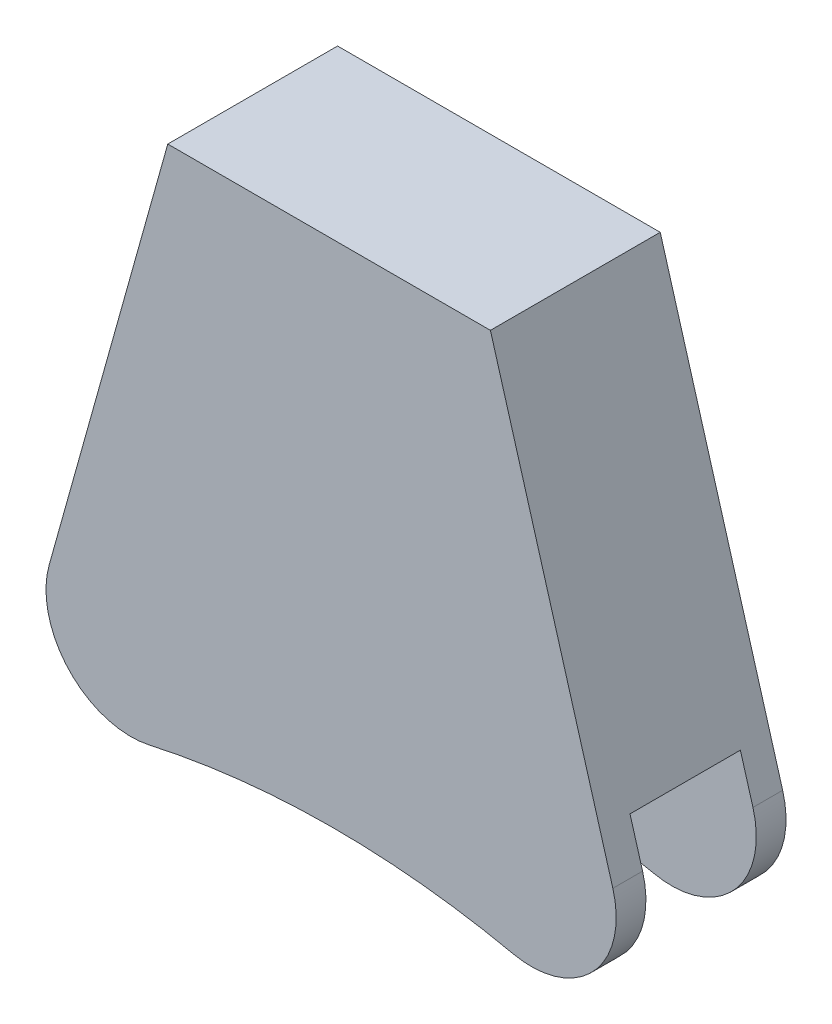
ISO-10303-21;
HEADER;
FILE_DESCRIPTION(('STEP AP214'),'2;1');
FILE_NAME('part.step','',(''),(''),'','','');
FILE_SCHEMA(('AUTOMOTIVE_DESIGN { 1 0 10303 214 1 1 1 1 }'));
ENDSEC;
DATA;
#1=APPLICATION_CONTEXT('core data for automotive mechanical design processes');
#2=APPLICATION_PROTOCOL_DEFINITION('international standard','automotive_design',2000,#1);
#3=PRODUCT_CONTEXT('',#1,'mechanical');
#4=PRODUCT('Part','Part','',(#3));
#5=PRODUCT_RELATED_PRODUCT_CATEGORY('part','',(#4));
#6=PRODUCT_DEFINITION_FORMATION('','',#4);
#7=PRODUCT_DEFINITION_CONTEXT('part definition',#1,'design');
#8=PRODUCT_DEFINITION('design','',#6,#7);
#9=PRODUCT_DEFINITION_SHAPE('','',#8);
#10=(LENGTH_UNIT() NAMED_UNIT(*) SI_UNIT(.MILLI.,.METRE.));
#11=(NAMED_UNIT(*) PLANE_ANGLE_UNIT() SI_UNIT($,.RADIAN.));
#12=(NAMED_UNIT(*) SI_UNIT($,.STERADIAN.) SOLID_ANGLE_UNIT());
#13=UNCERTAINTY_MEASURE_WITH_UNIT(LENGTH_MEASURE(1.E-05),#10,'distance_accuracy_value','');
#14=(GEOMETRIC_REPRESENTATION_CONTEXT(3) GLOBAL_UNCERTAINTY_ASSIGNED_CONTEXT((#13)) GLOBAL_UNIT_ASSIGNED_CONTEXT((#10,
#11,#12)) REPRESENTATION_CONTEXT('',''));
#15=CARTESIAN_POINT('',(0.,0.,0.));
#16=DIRECTION('',(0.,0.,1.));
#17=DIRECTION('',(1.,0.,0.));
#18=AXIS2_PLACEMENT_3D('',#15,#16,#17);
#19=CARTESIAN_POINT('',(-1.40770229888838,-160.,10.));
#20=DIRECTION('',(0.,0.,-1.));
#21=DIRECTION('',(-1.,0.,0.));
#22=AXIS2_PLACEMENT_3D('',#19,#20,#21);
#23=CYLINDRICAL_SURFACE('',#22,100.);
#24=CARTESIAN_POINT('',(-1.40770229888838,-160.,-10.));
#25=DIRECTION('',(0.,0.,-1.));
#26=DIRECTION('',(-1.,0.,0.));
#27=AXIS2_PLACEMENT_3D('',#24,#25,#26);
#28=CIRCLE('',#27,100.);
#29=CARTESIAN_POINT('',(-23.1221272501221,-62.3860473649528,-10.));
#30=VERTEX_POINT('',#29);
#31=CARTESIAN_POINT('',(19.7499055757312,-62.2638468680917,-10.));
#32=VERTEX_POINT('',#31);
#33=EDGE_CURVE('E181',#30,#32,#28,.T.);
#34=ORIENTED_EDGE('',*,*,#33,.T.);
#35=DIRECTION('',(0.,0.,-1.));
#36=VECTOR('',#35,1.);
#37=CARTESIAN_POINT('',(19.7499055757312,-62.2638468680916,10.));
#38=LINE('',#37,#36);
#39=CARTESIAN_POINT('',(19.7499055757312,-62.2638468680917,-6.50000000000002));
#40=VERTEX_POINT('',#39);
#41=EDGE_CURVE('E239',#32,#40,#38,.F.);
#42=ORIENTED_EDGE('',*,*,#41,.T.);
#43=CARTESIAN_POINT('',(-1.40770229888838,-160.,-6.50000000000002));
#44=DIRECTION('',(0.,0.,-1.));
#45=DIRECTION('',(-1.,0.,0.));
#46=AXIS2_PLACEMENT_3D('',#43,#44,#45);
#47=CIRCLE('',#46,100.);
#48=CARTESIAN_POINT('',(-23.1221272501221,-62.3860473649528,-6.50000000000002));
#49=VERTEX_POINT('',#48);
#50=EDGE_CURVE('E150',#40,#49,#47,.F.);
#51=ORIENTED_EDGE('',*,*,#50,.T.);
#52=DIRECTION('',(0.,0.,-1.));
#53=VECTOR('',#52,1.);
#54=CARTESIAN_POINT('',(-23.1221272501221,-62.3860473649528,10.));
#55=LINE('',#54,#53);
#56=EDGE_CURVE('E235',#49,#30,#55,.T.);
#57=ORIENTED_EDGE('',*,*,#56,.T.);
#58=EDGE_LOOP('',(#34,#42,#51,#57));
#59=FACE_BOUND('',#58,.T.);
#60=ADVANCED_FACE('F38',(#59),#23,.F.);
#61=CARTESIAN_POINT('',(-20.9513829902926,0.,10.));
#62=DIRECTION('',(0.,1.,0.));
#63=DIRECTION('',(-1.,0.,0.));
#64=AXIS2_PLACEMENT_3D('',#61,#62,#63);
#65=PLANE('',#64);
#66=DIRECTION('',(1.,0.,0.));
#67=VECTOR('',#66,1.);
#68=CARTESIAN_POINT('',(-20.9513829902926,0.,-10.));
#69=LINE('',#68,#67);
#70=CARTESIAN_POINT('',(-20.9513829902926,0.,-10.));
#71=VERTEX_POINT('',#70);
#72=CARTESIAN_POINT('',(17.0486170097074,0.,-10.));
#73=VERTEX_POINT('',#72);
#74=EDGE_CURVE('E149',#71,#73,#69,.T.);
#75=ORIENTED_EDGE('',*,*,#74,.F.);
#76=DIRECTION('',(0.,0.,-1.));
#77=VECTOR('',#76,1.);
#78=CARTESIAN_POINT('',(-20.9513829902926,0.,10.));
#79=LINE('',#78,#77);
#80=CARTESIAN_POINT('',(-20.9513829902926,0.,10.));
#81=VERTEX_POINT('',#80);
#82=EDGE_CURVE('E187',#81,#71,#79,.T.);
#83=ORIENTED_EDGE('',*,*,#82,.F.);
#84=DIRECTION('',(1.,0.,0.));
#85=VECTOR('',#84,1.);
#86=CARTESIAN_POINT('',(-20.9513829902926,0.,10.));
#87=LINE('',#86,#85);
#88=CARTESIAN_POINT('',(17.0486170097074,0.,10.));
#89=VERTEX_POINT('',#88);
#90=EDGE_CURVE('E161',#81,#89,#87,.T.);
#91=ORIENTED_EDGE('',*,*,#90,.T.);
#92=DIRECTION('',(0.,0.,-1.));
#93=VECTOR('',#92,1.);
#94=CARTESIAN_POINT('',(17.0486170097074,0.,10.));
#95=LINE('',#94,#93);
#96=EDGE_CURVE('E176',#89,#73,#95,.T.);
#97=ORIENTED_EDGE('',*,*,#96,.T.);
#98=EDGE_LOOP('',(#75,#83,#91,#97));
#99=FACE_BOUND('',#98,.T.);
#100=ADVANCED_FACE('F279',(#99),#65,.T.);
#101=CARTESIAN_POINT('',(-39.8975314430219,-67.7041005653263,10.));
#102=DIRECTION('',(-0.963004631843198,0.269484840108949,0.));
#103=DIRECTION('',(-0.269484840108949,-0.963004631843198,0.));
#104=AXIS2_PLACEMENT_3D('',#101,#102,#103);
#105=PLANE('',#104);
#106=DIRECTION('',(0.269484840108949,0.963004631843198,0.));
#107=VECTOR('',#106,1.);
#108=CARTESIAN_POINT('',(-39.8975314430219,-67.7041005653263,-10.));
#109=LINE('',#108,#107);
#110=CARTESIAN_POINT('',(-34.9236160636775,-49.9298037003586,-10.));
#111=VERTEX_POINT('',#110);
#112=EDGE_CURVE('E166',#111,#71,#109,.T.);
#113=ORIENTED_EDGE('',*,*,#112,.F.);
#114=DIRECTION('',(0.,0.,1.));
#115=VECTOR('',#114,1.);
#116=CARTESIAN_POINT('',(-34.9236160636775,-49.9298037003586,-6.50000000000002));
#117=LINE('',#116,#115);
#118=CARTESIAN_POINT('',(-34.9236160636775,-49.9298037003586,-6.50000000000002));
#119=VERTEX_POINT('',#118);
#120=EDGE_CURVE('E11',#111,#119,#117,.T.);
#121=ORIENTED_EDGE('',*,*,#120,.T.);
#122=DIRECTION('',(-0.269484840108949,-0.963004631843198,0.));
#123=VECTOR('',#122,1.);
#124=CARTESIAN_POINT('',(-39.8975314430219,-67.7041005653263,-6.50000000000002));
#125=LINE('',#124,#123);
#126=CARTESIAN_POINT('',(-33.7909251556847,-45.8821304048859,-6.50000000000002));
#127=VERTEX_POINT('',#126);
#128=EDGE_CURVE('E142',#127,#119,#125,.T.);
#129=ORIENTED_EDGE('',*,*,#128,.F.);
#130=DIRECTION('',(0.,0.,1.));
#131=VECTOR('',#130,1.);
#132=CARTESIAN_POINT('',(-33.7909251556847,-45.8821304048859,0.));
#133=LINE('',#132,#131);
#134=CARTESIAN_POINT('',(-33.7909251556847,-45.8821304048859,6.49999999999998));
#135=VERTEX_POINT('',#134);
#136=EDGE_CURVE('E130',#135,#127,#133,.F.);
#137=ORIENTED_EDGE('',*,*,#136,.F.);
#138=DIRECTION('',(0.269484840108949,0.963004631843198,0.));
#139=VECTOR('',#138,1.);
#140=CARTESIAN_POINT('',(-39.8975314430219,-67.7041005653263,6.49999999999998));
#141=LINE('',#140,#139);
#142=CARTESIAN_POINT('',(-34.9236160636775,-49.9298037003586,6.49999999999998));
#143=VERTEX_POINT('',#142);
#144=EDGE_CURVE('E157',#143,#135,#141,.T.);
#145=ORIENTED_EDGE('',*,*,#144,.F.);
#146=DIRECTION('',(0.,0.,1.));
#147=VECTOR('',#146,1.);
#148=CARTESIAN_POINT('',(-34.9236160636775,-49.9298037003586,10.));
#149=LINE('',#148,#147);
#150=CARTESIAN_POINT('',(-34.9236160636775,-49.9298037003586,10.));
#151=VERTEX_POINT('',#150);
#152=EDGE_CURVE('E47',#143,#151,#149,.T.);
#153=ORIENTED_EDGE('',*,*,#152,.T.);
#154=DIRECTION('',(0.269484840108949,0.963004631843198,0.));
#155=VECTOR('',#154,1.);
#156=CARTESIAN_POINT('',(-39.8975314430219,-67.7041005653263,10.));
#157=LINE('',#156,#155);
#158=EDGE_CURVE('E174',#151,#81,#157,.T.);
#159=ORIENTED_EDGE('',*,*,#158,.T.);
#160=ORIENTED_EDGE('',*,*,#82,.T.);
#161=EDGE_LOOP('',(#113,#121,#129,#137,#145,#153,#159,#160));
#162=FACE_BOUND('',#161,.T.);
#163=ADVANCED_FACE('F147',(#162),#105,.T.);
#164=CARTESIAN_POINT('',(-1.40770229888838,-160.,6.49999999999998));
#165=DIRECTION('',(0.,0.,1.));
#166=DIRECTION('',(1.,0.,0.));
#167=AXIS2_PLACEMENT_3D('',#164,#165,#166);
#168=CIRCLE('',#167,100.);
#169=CARTESIAN_POINT('',(-23.1221272501221,-62.3860473649528,6.49999999999998));
#170=VERTEX_POINT('',#169);
#171=CARTESIAN_POINT('',(19.7499055757312,-62.2638468680917,6.49999999999998));
#172=VERTEX_POINT('',#171);
#173=EDGE_CURVE('E139',#170,#172,#168,.F.);
#174=ORIENTED_EDGE('',*,*,#173,.T.);
#175=DIRECTION('',(0.,0.,-1.));
#176=VECTOR('',#175,1.);
#177=CARTESIAN_POINT('',(19.7499055757312,-62.2638468680916,10.));
#178=LINE('',#177,#176);
#179=CARTESIAN_POINT('',(19.7499055757312,-62.2638468680917,10.));
#180=VERTEX_POINT('',#179);
#181=EDGE_CURVE('E220',#172,#180,#178,.F.);
#182=ORIENTED_EDGE('',*,*,#181,.T.);
#183=CARTESIAN_POINT('',(-1.40770229888838,-160.,10.));
#184=DIRECTION('',(0.,0.,-1.));
#185=DIRECTION('',(-1.,0.,0.));
#186=AXIS2_PLACEMENT_3D('',#183,#184,#185);
#187=CIRCLE('',#186,100.);
#188=CARTESIAN_POINT('',(-23.1221272501221,-62.3860473649528,10.));
#189=VERTEX_POINT('',#188);
#190=EDGE_CURVE('E170',#189,#180,#187,.T.);
#191=ORIENTED_EDGE('',*,*,#190,.F.);
#192=DIRECTION('',(0.,0.,-1.));
#193=VECTOR('',#192,1.);
#194=CARTESIAN_POINT('',(-23.1221272501221,-62.3860473649528,10.));
#195=LINE('',#194,#193);
#196=EDGE_CURVE('E216',#189,#170,#195,.T.);
#197=ORIENTED_EDGE('',*,*,#196,.T.);
#198=EDGE_LOOP('',(#174,#182,#191,#197));
#199=FACE_BOUND('',#198,.T.);
#200=ADVANCED_FACE('F261',(#199),#23,.F.);
#201=CARTESIAN_POINT('',(17.0486170097074,0.,10.));
#202=DIRECTION('',(0.960393495176608,0.278647329831921,0.));
#203=DIRECTION('',(-0.278647329831921,0.960393495176608,0.));
#204=AXIS2_PLACEMENT_3D('',#201,#202,#203);
#205=PLANE('',#204);
#206=DIRECTION('',(0.278647329831921,-0.960393495176608,0.));
#207=VECTOR('',#206,1.);
#208=CARTESIAN_POINT('',(17.0486170097074,0.,10.));
#209=LINE('',#208,#207);
#210=CARTESIAN_POINT('',(31.4696013149592,-49.7037582565816,10.));
#211=VERTEX_POINT('',#210);
#212=EDGE_CURVE('E165',#89,#211,#209,.T.);
#213=ORIENTED_EDGE('',*,*,#212,.T.);
#214=DIRECTION('',(0.,0.,1.));
#215=VECTOR('',#214,1.);
#216=CARTESIAN_POINT('',(31.4696013149592,-49.7037582565816,6.49999999999998));
#217=LINE('',#216,#215);
#218=CARTESIAN_POINT('',(31.4696013149592,-49.7037582565816,6.49999999999998));
#219=VERTEX_POINT('',#218);
#220=EDGE_CURVE('E206',#211,#219,#217,.F.);
#221=ORIENTED_EDGE('',*,*,#220,.T.);
#222=DIRECTION('',(0.278647329831921,-0.960393495176608,0.));
#223=VECTOR('',#222,1.);
#224=CARTESIAN_POINT('',(17.0486170097074,0.,6.49999999999998));
#225=LINE('',#224,#223);
#226=CARTESIAN_POINT('',(29.9896205979097,-44.602816307852,6.49999999999998));
#227=VERTEX_POINT('',#226);
#228=EDGE_CURVE('E196',#227,#219,#225,.T.);
#229=ORIENTED_EDGE('',*,*,#228,.F.);
#230=DIRECTION('',(0.,0.,1.));
#231=VECTOR('',#230,1.);
#232=CARTESIAN_POINT('',(29.9896205979097,-44.602816307852,0.));
#233=LINE('',#232,#231);
#234=CARTESIAN_POINT('',(29.9896205979097,-44.602816307852,-6.50000000000002));
#235=VERTEX_POINT('',#234);
#236=EDGE_CURVE('E191',#235,#227,#233,.T.);
#237=ORIENTED_EDGE('',*,*,#236,.F.);
#238=DIRECTION('',(-0.278647329831921,0.960393495176608,0.));
#239=VECTOR('',#238,1.);
#240=CARTESIAN_POINT('',(17.0486170097074,0.,-6.50000000000002));
#241=LINE('',#240,#239);
#242=CARTESIAN_POINT('',(31.4696013149592,-49.7037582565816,-6.50000000000002));
#243=VERTEX_POINT('',#242);
#244=EDGE_CURVE('E144',#243,#235,#241,.T.);
#245=ORIENTED_EDGE('',*,*,#244,.F.);
#246=DIRECTION('',(0.,0.,1.));
#247=VECTOR('',#246,1.);
#248=CARTESIAN_POINT('',(31.4696013149592,-49.7037582565816,-10.));
#249=LINE('',#248,#247);
#250=CARTESIAN_POINT('',(31.4696013149592,-49.7037582565816,-10.));
#251=VERTEX_POINT('',#250);
#252=EDGE_CURVE('E202',#243,#251,#249,.F.);
#253=ORIENTED_EDGE('',*,*,#252,.T.);
#254=DIRECTION('',(0.278647329831921,-0.960393495176608,0.));
#255=VECTOR('',#254,1.);
#256=CARTESIAN_POINT('',(17.0486170097074,0.,-10.));
#257=LINE('',#256,#255);
#258=EDGE_CURVE('E155',#73,#251,#257,.T.);
#259=ORIENTED_EDGE('',*,*,#258,.F.);
#260=ORIENTED_EDGE('',*,*,#96,.F.);
#261=EDGE_LOOP('',(#213,#221,#229,#237,#245,#253,#259,#260));
#262=FACE_BOUND('',#261,.T.);
#263=ADVANCED_FACE('F272',(#262),#205,.T.);
#264=CARTESIAN_POINT('',(-1.40770229888838,-160.,10.));
#265=DIRECTION('',(0.,0.,-1.));
#266=DIRECTION('',(-1.,0.,0.));
#267=AXIS2_PLACEMENT_3D('',#264,#265,#266);
#268=PLANE('',#267);
#269=ORIENTED_EDGE('',*,*,#190,.T.);
#270=CARTESIAN_POINT('',(21.8656663631931,-52.4902315549008,10.));
#271=DIRECTION('',(0.,0.,-1.));
#272=DIRECTION('',(-1.,0.,0.));
#273=AXIS2_PLACEMENT_3D('',#270,#271,#272);
#274=CIRCLE('',#273,10.);
#275=EDGE_CURVE('E226',#180,#211,#274,.F.);
#276=ORIENTED_EDGE('',*,*,#275,.T.);
#277=ORIENTED_EDGE('',*,*,#212,.F.);
#278=ORIENTED_EDGE('',*,*,#90,.F.);
#279=ORIENTED_EDGE('',*,*,#158,.F.);
#280=CARTESIAN_POINT('',(-25.2935697452455,-52.6246521014481,10.));
#281=DIRECTION('',(0.,0.,-1.));
#282=DIRECTION('',(-1.,0.,0.));
#283=AXIS2_PLACEMENT_3D('',#280,#281,#282);
#284=CIRCLE('',#283,10.);
#285=EDGE_CURVE('E223',#151,#189,#284,.F.);
#286=ORIENTED_EDGE('',*,*,#285,.T.);
#287=EDGE_LOOP('',(#269,#276,#277,#278,#279,#286));
#288=FACE_BOUND('',#287,.T.);
#289=ADVANCED_FACE('F254',(#288),#268,.F.);
#290=CARTESIAN_POINT('',(-1.40770229888838,-160.,-10.));
#291=DIRECTION('',(0.,0.,-1.));
#292=DIRECTION('',(-1.,0.,0.));
#293=AXIS2_PLACEMENT_3D('',#290,#291,#292);
#294=PLANE('',#293);
#295=ORIENTED_EDGE('',*,*,#258,.T.);
#296=CARTESIAN_POINT('',(21.8656663631931,-52.4902315549008,-10.));
#297=DIRECTION('',(0.,0.,-1.));
#298=DIRECTION('',(-1.,0.,0.));
#299=AXIS2_PLACEMENT_3D('',#296,#297,#298);
#300=CIRCLE('',#299,10.);
#301=EDGE_CURVE('E232',#251,#32,#300,.T.);
#302=ORIENTED_EDGE('',*,*,#301,.T.);
#303=ORIENTED_EDGE('',*,*,#33,.F.);
#304=CARTESIAN_POINT('',(-25.2935697452455,-52.6246521014481,-10.));
#305=DIRECTION('',(0.,0.,-1.));
#306=DIRECTION('',(-1.,0.,0.));
#307=AXIS2_PLACEMENT_3D('',#304,#305,#306);
#308=CIRCLE('',#307,10.);
#309=EDGE_CURVE('E229',#30,#111,#308,.T.);
#310=ORIENTED_EDGE('',*,*,#309,.T.);
#311=ORIENTED_EDGE('',*,*,#112,.T.);
#312=ORIENTED_EDGE('',*,*,#74,.T.);
#313=EDGE_LOOP('',(#295,#302,#303,#310,#311,#312));
#314=FACE_BOUND('',#313,.T.);
#315=ADVANCED_FACE('F288',(#314),#294,.T.);
#316=CARTESIAN_POINT('',(0.,-140.,-6.50000000000002));
#317=DIRECTION('',(0.,0.,-1.));
#318=DIRECTION('',(-1.,0.,0.));
#319=AXIS2_PLACEMENT_3D('',#316,#317,#318);
#320=PLANE('',#319);
#321=ORIENTED_EDGE('',*,*,#50,.F.);
#322=CARTESIAN_POINT('',(21.8656663631931,-52.4902315549008,-6.50000000000002));
#323=DIRECTION('',(0.,0.,-1.));
#324=DIRECTION('',(-1.,0.,0.));
#325=AXIS2_PLACEMENT_3D('',#322,#323,#324);
#326=CIRCLE('',#325,10.);
#327=EDGE_CURVE('E244',#40,#243,#326,.F.);
#328=ORIENTED_EDGE('',*,*,#327,.T.);
#329=ORIENTED_EDGE('',*,*,#244,.T.);
#330=CARTESIAN_POINT('',(0.,-140.,-6.50000000000002));
#331=DIRECTION('',(0.,0.,1.));
#332=DIRECTION('',(1.,0.,0.));
#333=AXIS2_PLACEMENT_3D('',#330,#331,#332);
#334=CIRCLE('',#333,100.);
#335=EDGE_CURVE('E133',#235,#127,#334,.T.);
#336=ORIENTED_EDGE('',*,*,#335,.T.);
#337=ORIENTED_EDGE('',*,*,#128,.T.);
#338=CARTESIAN_POINT('',(-25.2935697452455,-52.6246521014481,-6.50000000000002));
#339=DIRECTION('',(0.,0.,-1.));
#340=DIRECTION('',(-1.,0.,0.));
#341=AXIS2_PLACEMENT_3D('',#338,#339,#340);
#342=CIRCLE('',#341,10.);
#343=EDGE_CURVE('E59',#119,#49,#342,.F.);
#344=ORIENTED_EDGE('',*,*,#343,.T.);
#345=EDGE_LOOP('',(#321,#328,#329,#336,#337,#344));
#346=FACE_BOUND('',#345,.T.);
#347=ADVANCED_FACE('F141',(#346),#320,.F.);
#348=CARTESIAN_POINT('',(0.,-140.,6.49999999999998));
#349=DIRECTION('',(0.,0.,1.));
#350=DIRECTION('',(1.,0.,0.));
#351=AXIS2_PLACEMENT_3D('',#348,#349,#350);
#352=PLANE('',#351);
#353=ORIENTED_EDGE('',*,*,#228,.T.);
#354=CARTESIAN_POINT('',(21.8656663631931,-52.4902315549008,6.49999999999998));
#355=DIRECTION('',(0.,0.,1.));
#356=DIRECTION('',(1.,0.,0.));
#357=AXIS2_PLACEMENT_3D('',#354,#355,#356);
#358=CIRCLE('',#357,10.);
#359=EDGE_CURVE('E213',#219,#172,#358,.F.);
#360=ORIENTED_EDGE('',*,*,#359,.T.);
#361=ORIENTED_EDGE('',*,*,#173,.F.);
#362=CARTESIAN_POINT('',(-25.2935697452455,-52.6246521014481,6.49999999999998));
#363=DIRECTION('',(0.,0.,1.));
#364=DIRECTION('',(1.,0.,0.));
#365=AXIS2_PLACEMENT_3D('',#362,#363,#364);
#366=CIRCLE('',#365,10.);
#367=EDGE_CURVE('E210',#170,#143,#366,.F.);
#368=ORIENTED_EDGE('',*,*,#367,.T.);
#369=ORIENTED_EDGE('',*,*,#144,.T.);
#370=CARTESIAN_POINT('',(0.,-140.,6.49999999999998));
#371=DIRECTION('',(0.,0.,1.));
#372=DIRECTION('',(1.,0.,0.));
#373=AXIS2_PLACEMENT_3D('',#370,#371,#372);
#374=CIRCLE('',#373,100.);
#375=EDGE_CURVE('E136',#227,#135,#374,.T.);
#376=ORIENTED_EDGE('',*,*,#375,.F.);
#377=EDGE_LOOP('',(#353,#360,#361,#368,#369,#376));
#378=FACE_BOUND('',#377,.T.);
#379=ADVANCED_FACE('F264',(#378),#352,.F.);
#380=CARTESIAN_POINT('',(0.,-140.,0.));
#381=DIRECTION('',(0.,0.,1.));
#382=DIRECTION('',(1.,0.,0.));
#383=AXIS2_PLACEMENT_3D('',#380,#381,#382);
#384=CYLINDRICAL_SURFACE('',#383,100.);
#385=ORIENTED_EDGE('',*,*,#136,.T.);
#386=ORIENTED_EDGE('',*,*,#335,.F.);
#387=ORIENTED_EDGE('',*,*,#236,.T.);
#388=ORIENTED_EDGE('',*,*,#375,.T.);
#389=EDGE_LOOP('',(#385,#386,#387,#388));
#390=FACE_BOUND('',#389,.T.);
#391=ADVANCED_FACE('F132',(#390),#384,.F.);
#392=CARTESIAN_POINT('',(21.8656663631931,-52.4902315549008,10.));
#393=DIRECTION('',(0.,0.,-1.));
#394=DIRECTION('',(-1.,0.,0.));
#395=AXIS2_PLACEMENT_3D('',#392,#393,#394);
#396=CYLINDRICAL_SURFACE('',#395,10.);
#397=ORIENTED_EDGE('',*,*,#275,.F.);
#398=ORIENTED_EDGE('',*,*,#181,.F.);
#399=ORIENTED_EDGE('',*,*,#359,.F.);
#400=ORIENTED_EDGE('',*,*,#220,.F.);
#401=EDGE_LOOP('',(#397,#398,#399,#400));
#402=FACE_BOUND('',#401,.T.);
#403=ADVANCED_FACE('F276',(#402),#396,.T.);
#404=CARTESIAN_POINT('',(21.8656663631931,-52.4902315549008,10.));
#405=DIRECTION('',(0.,0.,-1.));
#406=DIRECTION('',(-1.,0.,0.));
#407=AXIS2_PLACEMENT_3D('',#404,#405,#406);
#408=CYLINDRICAL_SURFACE('',#407,10.);
#409=ORIENTED_EDGE('',*,*,#327,.F.);
#410=ORIENTED_EDGE('',*,*,#41,.F.);
#411=ORIENTED_EDGE('',*,*,#301,.F.);
#412=ORIENTED_EDGE('',*,*,#252,.F.);
#413=EDGE_LOOP('',(#409,#410,#411,#412));
#414=FACE_BOUND('',#413,.T.);
#415=ADVANCED_FACE('F292',(#414),#408,.T.);
#416=CARTESIAN_POINT('',(-25.2935697452455,-52.6246521014481,10.));
#417=DIRECTION('',(0.,0.,-1.));
#418=DIRECTION('',(-1.,0.,0.));
#419=AXIS2_PLACEMENT_3D('',#416,#417,#418);
#420=CYLINDRICAL_SURFACE('',#419,10.);
#421=ORIENTED_EDGE('',*,*,#343,.F.);
#422=ORIENTED_EDGE('',*,*,#120,.F.);
#423=ORIENTED_EDGE('',*,*,#309,.F.);
#424=ORIENTED_EDGE('',*,*,#56,.F.);
#425=EDGE_LOOP('',(#421,#422,#423,#424));
#426=FACE_BOUND('',#425,.T.);
#427=ADVANCED_FACE('F283',(#426),#420,.T.);
#428=CARTESIAN_POINT('',(-25.2935697452455,-52.6246521014481,10.));
#429=DIRECTION('',(0.,0.,-1.));
#430=DIRECTION('',(-1.,0.,0.));
#431=AXIS2_PLACEMENT_3D('',#428,#429,#430);
#432=CYLINDRICAL_SURFACE('',#431,10.);
#433=ORIENTED_EDGE('',*,*,#285,.F.);
#434=ORIENTED_EDGE('',*,*,#152,.F.);
#435=ORIENTED_EDGE('',*,*,#367,.F.);
#436=ORIENTED_EDGE('',*,*,#196,.F.);
#437=EDGE_LOOP('',(#433,#434,#435,#436));
#438=FACE_BOUND('',#437,.T.);
#439=ADVANCED_FACE('F40',(#438),#432,.T.);
#440=CLOSED_SHELL('',(#60,#100,#163,#200,#263,#289,#315,#347,#379,#391,#403,#415,#427,#439));
#441=MANIFOLD_SOLID_BREP('B2',#440);
#442=ADVANCED_BREP_SHAPE_REPRESENTATION('',(#18,#441),#14);
#443=SHAPE_DEFINITION_REPRESENTATION(#9,#442);
ENDSEC;
END-ISO-10303-21;
